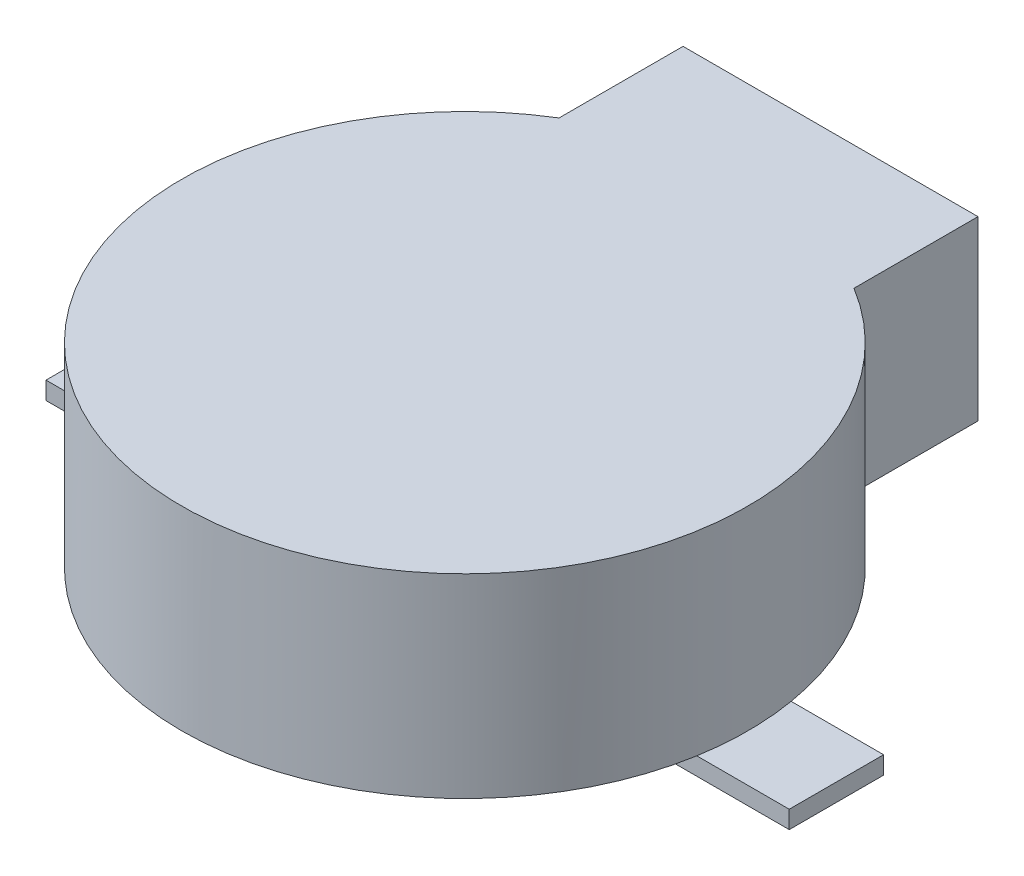
ISO-10303-21;
HEADER;
FILE_DESCRIPTION(('STEP AP214'),'2;1');
FILE_NAME('part.step','',(''),(''),'','','');
FILE_SCHEMA(('AUTOMOTIVE_DESIGN { 1 0 10303 214 1 1 1 1 }'));
ENDSEC;
DATA;
#1=APPLICATION_CONTEXT('core data for automotive mechanical design processes');
#2=APPLICATION_PROTOCOL_DEFINITION('international standard','automotive_design',2000,#1);
#3=PRODUCT_CONTEXT('',#1,'mechanical');
#4=PRODUCT('Part','Part','',(#3));
#5=PRODUCT_RELATED_PRODUCT_CATEGORY('part','',(#4));
#6=PRODUCT_DEFINITION_FORMATION('','',#4);
#7=PRODUCT_DEFINITION_CONTEXT('part definition',#1,'design');
#8=PRODUCT_DEFINITION('design','',#6,#7);
#9=PRODUCT_DEFINITION_SHAPE('','',#8);
#10=(LENGTH_UNIT() NAMED_UNIT(*) SI_UNIT(.MILLI.,.METRE.));
#11=(NAMED_UNIT(*) PLANE_ANGLE_UNIT() SI_UNIT($,.RADIAN.));
#12=(NAMED_UNIT(*) SI_UNIT($,.STERADIAN.) SOLID_ANGLE_UNIT());
#13=UNCERTAINTY_MEASURE_WITH_UNIT(LENGTH_MEASURE(1.E-05),#10,'distance_accuracy_value','');
#14=(GEOMETRIC_REPRESENTATION_CONTEXT(3) GLOBAL_UNCERTAINTY_ASSIGNED_CONTEXT((#13)) GLOBAL_UNIT_ASSIGNED_CONTEXT((#10,
#11,#12)) REPRESENTATION_CONTEXT('',''));
#15=CARTESIAN_POINT('',(0.,0.,0.));
#16=DIRECTION('',(0.,0.,1.));
#17=DIRECTION('',(1.,0.,0.));
#18=AXIS2_PLACEMENT_3D('',#15,#16,#17);
#19=CARTESIAN_POINT('',(2.5,3.3,-4.09756024970958));
#20=DIRECTION('',(-1.,0.,0.));
#21=DIRECTION('',(0.,0.,1.));
#22=AXIS2_PLACEMENT_3D('',#19,#20,#21);
#23=PLANE('',#22);
#24=DIRECTION('',(0.,0.,1.));
#25=VECTOR('',#24,1.);
#26=CARTESIAN_POINT('',(2.5,0.3,-4.09756024970958));
#27=LINE('',#26,#25);
#28=CARTESIAN_POINT('',(2.5,0.3,-6.2));
#29=VERTEX_POINT('',#28);
#30=CARTESIAN_POINT('',(2.5,0.3,-4.09756024970958));
#31=VERTEX_POINT('',#30);
#32=EDGE_CURVE('E206',#29,#31,#27,.T.);
#33=ORIENTED_EDGE('',*,*,#32,.F.);
#34=DIRECTION('',(0.,-1.,0.));
#35=VECTOR('',#34,1.);
#36=CARTESIAN_POINT('',(2.5,3.3,-6.2));
#37=LINE('',#36,#35);
#38=CARTESIAN_POINT('',(2.5,3.3,-6.2));
#39=VERTEX_POINT('',#38);
#40=EDGE_CURVE('E292',#39,#29,#37,.T.);
#41=ORIENTED_EDGE('',*,*,#40,.F.);
#42=DIRECTION('',(0.,0.,-1.));
#43=VECTOR('',#42,1.);
#44=CARTESIAN_POINT('',(2.5,3.3,-4.09756024970958));
#45=LINE('',#44,#43);
#46=CARTESIAN_POINT('',(2.5,3.3,-4.09756024970958));
#47=VERTEX_POINT('',#46);
#48=EDGE_CURVE('E277',#47,#39,#45,.T.);
#49=ORIENTED_EDGE('',*,*,#48,.F.);
#50=DIRECTION('',(0.,-1.,0.));
#51=VECTOR('',#50,1.);
#52=CARTESIAN_POINT('',(2.5,3.3,-4.09756024970958));
#53=LINE('',#52,#51);
#54=EDGE_CURVE('E40',#47,#31,#53,.T.);
#55=ORIENTED_EDGE('',*,*,#54,.T.);
#56=EDGE_LOOP('',(#33,#41,#49,#55));
#57=FACE_BOUND('',#56,.T.);
#58=ADVANCED_FACE('F36',(#57),#23,.F.);
#59=CARTESIAN_POINT('',(-2.5,3.3,-6.2));
#60=DIRECTION('',(0.,0.,1.));
#61=DIRECTION('',(1.,0.,0.));
#62=AXIS2_PLACEMENT_3D('',#59,#60,#61);
#63=PLANE('',#62);
#64=DIRECTION('',(-1.,0.,0.));
#65=VECTOR('',#64,1.);
#66=CARTESIAN_POINT('',(2.,0.8,-6.2));
#67=LINE('',#66,#65);
#68=CARTESIAN_POINT('',(2.,0.8,-6.2));
#69=VERTEX_POINT('',#68);
#70=CARTESIAN_POINT('',(-2.,0.8,-6.2));
#71=VERTEX_POINT('',#70);
#72=EDGE_CURVE('E192',#69,#71,#67,.T.);
#73=ORIENTED_EDGE('',*,*,#72,.F.);
#74=DIRECTION('',(0.,-1.,0.));
#75=VECTOR('',#74,1.);
#76=CARTESIAN_POINT('',(2.,2.8,-6.2));
#77=LINE('',#76,#75);
#78=CARTESIAN_POINT('',(2.,2.8,-6.2));
#79=VERTEX_POINT('',#78);
#80=EDGE_CURVE('E53',#79,#69,#77,.T.);
#81=ORIENTED_EDGE('',*,*,#80,.F.);
#82=DIRECTION('',(1.,0.,0.));
#83=VECTOR('',#82,1.);
#84=CARTESIAN_POINT('',(-2.,2.8,-6.2));
#85=LINE('',#84,#83);
#86=CARTESIAN_POINT('',(-2.,2.8,-6.2));
#87=VERTEX_POINT('',#86);
#88=EDGE_CURVE('E183',#87,#79,#85,.T.);
#89=ORIENTED_EDGE('',*,*,#88,.F.);
#90=DIRECTION('',(0.,1.,0.));
#91=VECTOR('',#90,1.);
#92=CARTESIAN_POINT('',(-2.,0.8,-6.2));
#93=LINE('',#92,#91);
#94=EDGE_CURVE('E186',#71,#87,#93,.T.);
#95=ORIENTED_EDGE('',*,*,#94,.F.);
#96=EDGE_LOOP('',(#73,#81,#89,#95));
#97=FACE_BOUND('',#96,.T.);
#98=DIRECTION('',(1.,0.,0.));
#99=VECTOR('',#98,1.);
#100=CARTESIAN_POINT('',(2.5,0.3,-6.2));
#101=LINE('',#100,#99);
#102=CARTESIAN_POINT('',(-2.5,0.3,-6.2));
#103=VERTEX_POINT('',#102);
#104=EDGE_CURVE('E204',#103,#29,#101,.T.);
#105=ORIENTED_EDGE('',*,*,#104,.F.);
#106=DIRECTION('',(0.,-1.,0.));
#107=VECTOR('',#106,1.);
#108=CARTESIAN_POINT('',(-2.5,3.3,-6.2));
#109=LINE('',#108,#107);
#110=CARTESIAN_POINT('',(-2.5,3.3,-6.2));
#111=VERTEX_POINT('',#110);
#112=EDGE_CURVE('E290',#111,#103,#109,.T.);
#113=ORIENTED_EDGE('',*,*,#112,.F.);
#114=DIRECTION('',(-1.,0.,0.));
#115=VECTOR('',#114,1.);
#116=CARTESIAN_POINT('',(-2.5,3.3,-6.2));
#117=LINE('',#116,#115);
#118=EDGE_CURVE('E280',#39,#111,#117,.T.);
#119=ORIENTED_EDGE('',*,*,#118,.F.);
#120=ORIENTED_EDGE('',*,*,#40,.T.);
#121=EDGE_LOOP('',(#105,#113,#119,#120));
#122=FACE_BOUND('',#121,.T.);
#123=ADVANCED_FACE('F307',(#97,#122),#63,.F.);
#124=CARTESIAN_POINT('',(-2.5,3.3,-4.09756024970958));
#125=DIRECTION('',(1.,0.,0.));
#126=DIRECTION('',(0.,0.,-1.));
#127=AXIS2_PLACEMENT_3D('',#124,#125,#126);
#128=PLANE('',#127);
#129=DIRECTION('',(0.,0.,-1.));
#130=VECTOR('',#129,1.);
#131=CARTESIAN_POINT('',(-2.5,0.3,-6.2));
#132=LINE('',#131,#130);
#133=CARTESIAN_POINT('',(-2.5,0.3,-4.09756024970958));
#134=VERTEX_POINT('',#133);
#135=EDGE_CURVE('E202',#134,#103,#132,.T.);
#136=ORIENTED_EDGE('',*,*,#135,.F.);
#137=DIRECTION('',(0.,-1.,0.));
#138=VECTOR('',#137,1.);
#139=CARTESIAN_POINT('',(-2.5,3.3,-4.09756024970958));
#140=LINE('',#139,#138);
#141=CARTESIAN_POINT('',(-2.5,3.3,-4.09756024970958));
#142=VERTEX_POINT('',#141);
#143=EDGE_CURVE('E284',#142,#134,#140,.T.);
#144=ORIENTED_EDGE('',*,*,#143,.F.);
#145=DIRECTION('',(0.,0.,1.));
#146=VECTOR('',#145,1.);
#147=CARTESIAN_POINT('',(-2.5,3.3,-4.09756024970958));
#148=LINE('',#147,#146);
#149=EDGE_CURVE('E282',#111,#142,#148,.T.);
#150=ORIENTED_EDGE('',*,*,#149,.F.);
#151=ORIENTED_EDGE('',*,*,#112,.T.);
#152=EDGE_LOOP('',(#136,#144,#150,#151));
#153=FACE_BOUND('',#152,.T.);
#154=ADVANCED_FACE('F310',(#153),#128,.F.);
#155=CARTESIAN_POINT('',(0.,0.,0.));
#156=DIRECTION('',(0.,1.,0.));
#157=DIRECTION('',(0.,0.,1.));
#158=AXIS2_PLACEMENT_3D('',#155,#156,#157);
#159=PLANE('',#158);
#160=CARTESIAN_POINT('',(0.,0.,0.));
#161=DIRECTION('',(0.,1.,0.));
#162=DIRECTION('',(0.,0.,1.));
#163=AXIS2_PLACEMENT_3D('',#160,#161,#162);
#164=CIRCLE('',#163,4.8);
#165=CARTESIAN_POINT('',(4.73286382647969,0.,-0.8));
#166=VERTEX_POINT('',#165);
#167=CARTESIAN_POINT('',(-4.73286382647969,0.,-0.8));
#168=VERTEX_POINT('',#167);
#169=EDGE_CURVE('E278',#166,#168,#164,.T.);
#170=ORIENTED_EDGE('',*,*,#169,.F.);
#171=DIRECTION('',(1.,0.,0.));
#172=VECTOR('',#171,1.);
#173=CARTESIAN_POINT('',(2.8,0.,-0.8));
#174=LINE('',#173,#172);
#175=CARTESIAN_POINT('',(2.8,0.,-0.8));
#176=VERTEX_POINT('',#175);
#177=EDGE_CURVE('E223',#176,#166,#174,.T.);
#178=ORIENTED_EDGE('',*,*,#177,.F.);
#179=DIRECTION('',(0.,0.,-1.));
#180=VECTOR('',#179,1.);
#181=CARTESIAN_POINT('',(2.8,0.,0.8));
#182=LINE('',#181,#180);
#183=CARTESIAN_POINT('',(2.8,0.,0.8));
#184=VERTEX_POINT('',#183);
#185=EDGE_CURVE('E208',#184,#176,#182,.T.);
#186=ORIENTED_EDGE('',*,*,#185,.F.);
#187=DIRECTION('',(-1.,0.,0.));
#188=VECTOR('',#187,1.);
#189=CARTESIAN_POINT('',(2.8,0.,0.8));
#190=LINE('',#189,#188);
#191=CARTESIAN_POINT('',(4.73286382647969,0.,0.8));
#192=VERTEX_POINT('',#191);
#193=EDGE_CURVE('E228',#192,#184,#190,.T.);
#194=ORIENTED_EDGE('',*,*,#193,.F.);
#195=CARTESIAN_POINT('',(-4.73286382647969,0.,0.8));
#196=VERTEX_POINT('',#195);
#197=EDGE_CURVE('E353',#196,#192,#164,.T.);
#198=ORIENTED_EDGE('',*,*,#197,.F.);
#199=DIRECTION('',(-1.,0.,0.));
#200=VECTOR('',#199,1.);
#201=CARTESIAN_POINT('',(-6.3,0.,0.8));
#202=LINE('',#201,#200);
#203=CARTESIAN_POINT('',(-2.8,0.,0.8));
#204=VERTEX_POINT('',#203);
#205=EDGE_CURVE('E246',#204,#196,#202,.T.);
#206=ORIENTED_EDGE('',*,*,#205,.F.);
#207=DIRECTION('',(0.,0.,1.));
#208=VECTOR('',#207,1.);
#209=CARTESIAN_POINT('',(-2.8,0.,0.8));
#210=LINE('',#209,#208);
#211=CARTESIAN_POINT('',(-2.8,0.,-0.8));
#212=VERTEX_POINT('',#211);
#213=EDGE_CURVE('E256',#212,#204,#210,.T.);
#214=ORIENTED_EDGE('',*,*,#213,.F.);
#215=DIRECTION('',(1.,0.,0.));
#216=VECTOR('',#215,1.);
#217=CARTESIAN_POINT('',(-6.3,0.,-0.8));
#218=LINE('',#217,#216);
#219=EDGE_CURVE('E11',#168,#212,#218,.T.);
#220=ORIENTED_EDGE('',*,*,#219,.F.);
#221=EDGE_LOOP('',(#170,#178,#186,#194,#198,#206,#214,#220));
#222=FACE_BOUND('',#221,.T.);
#223=ADVANCED_FACE('F323',(#222),#159,.F.);
#224=CARTESIAN_POINT('',(0.,3.3,0.));
#225=DIRECTION('',(0.,-1.,0.));
#226=DIRECTION('',(0.,0.,-1.));
#227=AXIS2_PLACEMENT_3D('',#224,#225,#226);
#228=CYLINDRICAL_SURFACE('',#227,4.8);
#229=EDGE_CURVE('E273',#192,#166,#164,.T.);
#230=ORIENTED_EDGE('',*,*,#229,.T.);
#231=ORIENTED_EDGE('',*,*,#169,.T.);
#232=EDGE_CURVE('E287',#168,#196,#164,.T.);
#233=ORIENTED_EDGE('',*,*,#232,.T.);
#234=ORIENTED_EDGE('',*,*,#197,.T.);
#235=EDGE_LOOP('',(#230,#231,#233,#234));
#236=FACE_BOUND('',#235,.T.);
#237=CARTESIAN_POINT('',(0.,0.3,0.));
#238=DIRECTION('',(0.,1.,0.));
#239=DIRECTION('',(0.,0.,-1.));
#240=AXIS2_PLACEMENT_3D('',#237,#238,#239);
#241=CIRCLE('',#240,4.8);
#242=EDGE_CURVE('E61',#31,#134,#241,.T.);
#243=ORIENTED_EDGE('',*,*,#242,.F.);
#244=ORIENTED_EDGE('',*,*,#54,.F.);
#245=CARTESIAN_POINT('',(0.,3.3,0.));
#246=DIRECTION('',(0.,1.,0.));
#247=DIRECTION('',(0.,0.,1.));
#248=AXIS2_PLACEMENT_3D('',#245,#246,#247);
#249=CIRCLE('',#248,4.8);
#250=EDGE_CURVE('E274',#142,#47,#249,.T.);
#251=ORIENTED_EDGE('',*,*,#250,.F.);
#252=ORIENTED_EDGE('',*,*,#143,.T.);
#253=EDGE_LOOP('',(#243,#244,#251,#252));
#254=FACE_BOUND('',#253,.T.);
#255=ADVANCED_FACE('F38',(#236,#254),#228,.T.);
#256=CARTESIAN_POINT('',(0.,3.3,0.));
#257=DIRECTION('',(0.,1.,0.));
#258=DIRECTION('',(0.,0.,1.));
#259=AXIS2_PLACEMENT_3D('',#256,#257,#258);
#260=PLANE('',#259);
#261=ORIENTED_EDGE('',*,*,#250,.T.);
#262=ORIENTED_EDGE('',*,*,#48,.T.);
#263=ORIENTED_EDGE('',*,*,#118,.T.);
#264=ORIENTED_EDGE('',*,*,#149,.T.);
#265=EDGE_LOOP('',(#261,#262,#263,#264));
#266=FACE_BOUND('',#265,.T.);
#267=ADVANCED_FACE('F312',(#266),#260,.T.);
#268=CARTESIAN_POINT('',(-6.3,-0.3,0.8));
#269=DIRECTION('',(1.,0.,0.));
#270=DIRECTION('',(0.,0.,-1.));
#271=AXIS2_PLACEMENT_3D('',#268,#269,#270);
#272=PLANE('',#271);
#273=DIRECTION('',(0.,0.,-1.));
#274=VECTOR('',#273,1.);
#275=CARTESIAN_POINT('',(-6.3,0.,0.8));
#276=LINE('',#275,#274);
#277=CARTESIAN_POINT('',(-6.3,0.,0.8));
#278=VERTEX_POINT('',#277);
#279=CARTESIAN_POINT('',(-6.3,0.,-0.8));
#280=VERTEX_POINT('',#279);
#281=EDGE_CURVE('E241',#278,#280,#276,.T.);
#282=ORIENTED_EDGE('',*,*,#281,.T.);
#283=DIRECTION('',(0.,1.,0.));
#284=VECTOR('',#283,1.);
#285=CARTESIAN_POINT('',(-6.3,-0.3,-0.8));
#286=LINE('',#285,#284);
#287=CARTESIAN_POINT('',(-6.3,-0.3,-0.8));
#288=VERTEX_POINT('',#287);
#289=EDGE_CURVE('E270',#288,#280,#286,.T.);
#290=ORIENTED_EDGE('',*,*,#289,.F.);
#291=DIRECTION('',(0.,0.,-1.));
#292=VECTOR('',#291,1.);
#293=CARTESIAN_POINT('',(-6.3,-0.3,0.8));
#294=LINE('',#293,#292);
#295=CARTESIAN_POINT('',(-6.3,-0.3,0.8));
#296=VERTEX_POINT('',#295);
#297=EDGE_CURVE('E242',#296,#288,#294,.T.);
#298=ORIENTED_EDGE('',*,*,#297,.F.);
#299=DIRECTION('',(0.,1.,0.));
#300=VECTOR('',#299,1.);
#301=CARTESIAN_POINT('',(-6.3,-0.3,0.8));
#302=LINE('',#301,#300);
#303=EDGE_CURVE('E252',#296,#278,#302,.T.);
#304=ORIENTED_EDGE('',*,*,#303,.T.);
#305=EDGE_LOOP('',(#282,#290,#298,#304));
#306=FACE_BOUND('',#305,.T.);
#307=ADVANCED_FACE('F314',(#306),#272,.F.);
#308=CARTESIAN_POINT('',(-6.3,-0.3,-0.8));
#309=DIRECTION('',(0.,0.,1.));
#310=DIRECTION('',(1.,0.,0.));
#311=AXIS2_PLACEMENT_3D('',#308,#309,#310);
#312=PLANE('',#311);
#313=EDGE_CURVE('E46',#280,#168,#218,.T.);
#314=ORIENTED_EDGE('',*,*,#313,.T.);
#315=ORIENTED_EDGE('',*,*,#219,.T.);
#316=DIRECTION('',(0.,1.,0.));
#317=VECTOR('',#316,1.);
#318=CARTESIAN_POINT('',(-2.8,-0.3,-0.8));
#319=LINE('',#318,#317);
#320=CARTESIAN_POINT('',(-2.8,-0.3,-0.8));
#321=VERTEX_POINT('',#320);
#322=EDGE_CURVE('E267',#321,#212,#319,.T.);
#323=ORIENTED_EDGE('',*,*,#322,.F.);
#324=DIRECTION('',(1.,0.,0.));
#325=VECTOR('',#324,1.);
#326=CARTESIAN_POINT('',(-6.3,-0.3,-0.8));
#327=LINE('',#326,#325);
#328=EDGE_CURVE('E245',#288,#321,#327,.T.);
#329=ORIENTED_EDGE('',*,*,#328,.F.);
#330=ORIENTED_EDGE('',*,*,#289,.T.);
#331=EDGE_LOOP('',(#314,#315,#323,#329,#330));
#332=FACE_BOUND('',#331,.T.);
#333=ADVANCED_FACE('F320',(#332),#312,.F.);
#334=CARTESIAN_POINT('',(-2.8,-0.3,0.8));
#335=DIRECTION('',(-1.,0.,0.));
#336=DIRECTION('',(0.,0.,1.));
#337=AXIS2_PLACEMENT_3D('',#334,#335,#336);
#338=PLANE('',#337);
#339=ORIENTED_EDGE('',*,*,#213,.T.);
#340=DIRECTION('',(0.,1.,0.));
#341=VECTOR('',#340,1.);
#342=CARTESIAN_POINT('',(-2.8,-0.3,0.8));
#343=LINE('',#342,#341);
#344=CARTESIAN_POINT('',(-2.8,-0.3,0.8));
#345=VERTEX_POINT('',#344);
#346=EDGE_CURVE('E264',#345,#204,#343,.T.);
#347=ORIENTED_EDGE('',*,*,#346,.F.);
#348=DIRECTION('',(0.,0.,1.));
#349=VECTOR('',#348,1.);
#350=CARTESIAN_POINT('',(-2.8,-0.3,0.8));
#351=LINE('',#350,#349);
#352=EDGE_CURVE('E248',#321,#345,#351,.T.);
#353=ORIENTED_EDGE('',*,*,#352,.F.);
#354=ORIENTED_EDGE('',*,*,#322,.T.);
#355=EDGE_LOOP('',(#339,#347,#353,#354));
#356=FACE_BOUND('',#355,.T.);
#357=ADVANCED_FACE('F365',(#356),#338,.F.);
#358=CARTESIAN_POINT('',(-6.3,-0.3,0.8));
#359=DIRECTION('',(0.,0.,-1.));
#360=DIRECTION('',(-1.,0.,0.));
#361=AXIS2_PLACEMENT_3D('',#358,#359,#360);
#362=PLANE('',#361);
#363=ORIENTED_EDGE('',*,*,#205,.T.);
#364=EDGE_CURVE('E259',#196,#278,#202,.T.);
#365=ORIENTED_EDGE('',*,*,#364,.T.);
#366=ORIENTED_EDGE('',*,*,#303,.F.);
#367=DIRECTION('',(-1.,0.,0.));
#368=VECTOR('',#367,1.);
#369=CARTESIAN_POINT('',(-6.3,-0.3,0.8));
#370=LINE('',#369,#368);
#371=EDGE_CURVE('E250',#345,#296,#370,.T.);
#372=ORIENTED_EDGE('',*,*,#371,.F.);
#373=ORIENTED_EDGE('',*,*,#346,.T.);
#374=EDGE_LOOP('',(#363,#365,#366,#372,#373));
#375=FACE_BOUND('',#374,.T.);
#376=ADVANCED_FACE('F360',(#375),#362,.F.);
#377=CARTESIAN_POINT('',(0.,-0.3,0.));
#378=DIRECTION('',(0.,-1.,0.));
#379=DIRECTION('',(0.,0.,-1.));
#380=AXIS2_PLACEMENT_3D('',#377,#378,#379);
#381=PLANE('',#380);
#382=ORIENTED_EDGE('',*,*,#297,.T.);
#383=ORIENTED_EDGE('',*,*,#328,.T.);
#384=ORIENTED_EDGE('',*,*,#352,.T.);
#385=ORIENTED_EDGE('',*,*,#371,.T.);
#386=EDGE_LOOP('',(#382,#383,#384,#385));
#387=FACE_BOUND('',#386,.T.);
#388=ADVANCED_FACE('F372',(#387),#381,.T.);
#389=CARTESIAN_POINT('',(0.,0.,0.));
#390=DIRECTION('',(0.,-1.,0.));
#391=DIRECTION('',(0.,0.,-1.));
#392=AXIS2_PLACEMENT_3D('',#389,#390,#391);
#393=PLANE('',#392);
#394=ORIENTED_EDGE('',*,*,#232,.F.);
#395=ORIENTED_EDGE('',*,*,#313,.F.);
#396=ORIENTED_EDGE('',*,*,#281,.F.);
#397=ORIENTED_EDGE('',*,*,#364,.F.);
#398=EDGE_LOOP('',(#394,#395,#396,#397));
#399=FACE_BOUND('',#398,.T.);
#400=ADVANCED_FACE('F357',(#399),#393,.F.);
#401=CARTESIAN_POINT('',(2.8,-0.3,0.8));
#402=DIRECTION('',(1.,0.,0.));
#403=DIRECTION('',(0.,0.,-1.));
#404=AXIS2_PLACEMENT_3D('',#401,#402,#403);
#405=PLANE('',#404);
#406=ORIENTED_EDGE('',*,*,#185,.T.);
#407=DIRECTION('',(0.,1.,0.));
#408=VECTOR('',#407,1.);
#409=CARTESIAN_POINT('',(2.8,-0.3,-0.8));
#410=LINE('',#409,#408);
#411=CARTESIAN_POINT('',(2.8,-0.3,-0.8));
#412=VERTEX_POINT('',#411);
#413=EDGE_CURVE('E239',#412,#176,#410,.T.);
#414=ORIENTED_EDGE('',*,*,#413,.F.);
#415=DIRECTION('',(0.,0.,-1.));
#416=VECTOR('',#415,1.);
#417=CARTESIAN_POINT('',(2.8,-0.3,0.8));
#418=LINE('',#417,#416);
#419=CARTESIAN_POINT('',(2.8,-0.3,0.8));
#420=VERTEX_POINT('',#419);
#421=EDGE_CURVE('E209',#420,#412,#418,.T.);
#422=ORIENTED_EDGE('',*,*,#421,.F.);
#423=DIRECTION('',(0.,1.,0.));
#424=VECTOR('',#423,1.);
#425=CARTESIAN_POINT('',(2.8,-0.3,0.8));
#426=LINE('',#425,#424);
#427=EDGE_CURVE('E219',#420,#184,#426,.T.);
#428=ORIENTED_EDGE('',*,*,#427,.T.);
#429=EDGE_LOOP('',(#406,#414,#422,#428));
#430=FACE_BOUND('',#429,.T.);
#431=ADVANCED_FACE('F379',(#430),#405,.F.);
#432=CARTESIAN_POINT('',(2.8,-0.3,-0.8));
#433=DIRECTION('',(0.,0.,1.));
#434=DIRECTION('',(1.,0.,0.));
#435=AXIS2_PLACEMENT_3D('',#432,#433,#434);
#436=PLANE('',#435);
#437=ORIENTED_EDGE('',*,*,#177,.T.);
#438=CARTESIAN_POINT('',(6.3,0.,-0.8));
#439=VERTEX_POINT('',#438);
#440=EDGE_CURVE('E222',#166,#439,#174,.T.);
#441=ORIENTED_EDGE('',*,*,#440,.T.);
#442=DIRECTION('',(0.,1.,0.));
#443=VECTOR('',#442,1.);
#444=CARTESIAN_POINT('',(6.3,-0.3,-0.8));
#445=LINE('',#444,#443);
#446=CARTESIAN_POINT('',(6.3,-0.3,-0.8));
#447=VERTEX_POINT('',#446);
#448=EDGE_CURVE('E236',#447,#439,#445,.T.);
#449=ORIENTED_EDGE('',*,*,#448,.F.);
#450=DIRECTION('',(1.,0.,0.));
#451=VECTOR('',#450,1.);
#452=CARTESIAN_POINT('',(2.8,-0.3,-0.8));
#453=LINE('',#452,#451);
#454=EDGE_CURVE('E212',#412,#447,#453,.T.);
#455=ORIENTED_EDGE('',*,*,#454,.F.);
#456=ORIENTED_EDGE('',*,*,#413,.T.);
#457=EDGE_LOOP('',(#437,#441,#449,#455,#456));
#458=FACE_BOUND('',#457,.T.);
#459=ADVANCED_FACE('F345',(#458),#436,.F.);
#460=CARTESIAN_POINT('',(6.3,-0.3,0.8));
#461=DIRECTION('',(-1.,0.,0.));
#462=DIRECTION('',(0.,0.,1.));
#463=AXIS2_PLACEMENT_3D('',#460,#461,#462);
#464=PLANE('',#463);
#465=DIRECTION('',(0.,0.,1.));
#466=VECTOR('',#465,1.);
#467=CARTESIAN_POINT('',(6.3,0.,0.8));
#468=LINE('',#467,#466);
#469=CARTESIAN_POINT('',(6.3,0.,0.8));
#470=VERTEX_POINT('',#469);
#471=EDGE_CURVE('E226',#439,#470,#468,.T.);
#472=ORIENTED_EDGE('',*,*,#471,.T.);
#473=DIRECTION('',(0.,1.,0.));
#474=VECTOR('',#473,1.);
#475=CARTESIAN_POINT('',(6.3,-0.3,0.8));
#476=LINE('',#475,#474);
#477=CARTESIAN_POINT('',(6.3,-0.3,0.8));
#478=VERTEX_POINT('',#477);
#479=EDGE_CURVE('E233',#478,#470,#476,.T.);
#480=ORIENTED_EDGE('',*,*,#479,.F.);
#481=DIRECTION('',(0.,0.,1.));
#482=VECTOR('',#481,1.);
#483=CARTESIAN_POINT('',(6.3,-0.3,0.8));
#484=LINE('',#483,#482);
#485=EDGE_CURVE('E215',#447,#478,#484,.T.);
#486=ORIENTED_EDGE('',*,*,#485,.F.);
#487=ORIENTED_EDGE('',*,*,#448,.T.);
#488=EDGE_LOOP('',(#472,#480,#486,#487));
#489=FACE_BOUND('',#488,.T.);
#490=ADVANCED_FACE('F427',(#489),#464,.F.);
#491=CARTESIAN_POINT('',(2.8,-0.3,0.8));
#492=DIRECTION('',(0.,0.,-1.));
#493=DIRECTION('',(-1.,0.,0.));
#494=AXIS2_PLACEMENT_3D('',#491,#492,#493);
#495=PLANE('',#494);
#496=EDGE_CURVE('E213',#470,#192,#190,.T.);
#497=ORIENTED_EDGE('',*,*,#496,.T.);
#498=ORIENTED_EDGE('',*,*,#193,.T.);
#499=ORIENTED_EDGE('',*,*,#427,.F.);
#500=DIRECTION('',(-1.,0.,0.));
#501=VECTOR('',#500,1.);
#502=CARTESIAN_POINT('',(2.8,-0.3,0.8));
#503=LINE('',#502,#501);
#504=EDGE_CURVE('E217',#478,#420,#503,.T.);
#505=ORIENTED_EDGE('',*,*,#504,.F.);
#506=ORIENTED_EDGE('',*,*,#479,.T.);
#507=EDGE_LOOP('',(#497,#498,#499,#505,#506));
#508=FACE_BOUND('',#507,.T.);
#509=ADVANCED_FACE('F435',(#508),#495,.F.);
#510=CARTESIAN_POINT('',(0.,-0.3,0.));
#511=DIRECTION('',(0.,-1.,0.));
#512=DIRECTION('',(0.,0.,-1.));
#513=AXIS2_PLACEMENT_3D('',#510,#511,#512);
#514=PLANE('',#513);
#515=ORIENTED_EDGE('',*,*,#421,.T.);
#516=ORIENTED_EDGE('',*,*,#454,.T.);
#517=ORIENTED_EDGE('',*,*,#485,.T.);
#518=ORIENTED_EDGE('',*,*,#504,.T.);
#519=EDGE_LOOP('',(#515,#516,#517,#518));
#520=FACE_BOUND('',#519,.T.);
#521=ADVANCED_FACE('F445',(#520),#514,.T.);
#522=CARTESIAN_POINT('',(0.,0.,0.));
#523=DIRECTION('',(0.,-1.,0.));
#524=DIRECTION('',(0.,0.,-1.));
#525=AXIS2_PLACEMENT_3D('',#522,#523,#524);
#526=PLANE('',#525);
#527=ORIENTED_EDGE('',*,*,#440,.F.);
#528=ORIENTED_EDGE('',*,*,#229,.F.);
#529=ORIENTED_EDGE('',*,*,#496,.F.);
#530=ORIENTED_EDGE('',*,*,#471,.F.);
#531=EDGE_LOOP('',(#527,#528,#529,#530));
#532=FACE_BOUND('',#531,.T.);
#533=ADVANCED_FACE('F350',(#532),#526,.F.);
#534=CARTESIAN_POINT('',(0.,0.3,0.));
#535=DIRECTION('',(0.,-1.,0.));
#536=DIRECTION('',(0.,0.,-1.));
#537=AXIS2_PLACEMENT_3D('',#534,#535,#536);
#538=PLANE('',#537);
#539=ORIENTED_EDGE('',*,*,#242,.T.);
#540=ORIENTED_EDGE('',*,*,#135,.T.);
#541=ORIENTED_EDGE('',*,*,#104,.T.);
#542=ORIENTED_EDGE('',*,*,#32,.T.);
#543=EDGE_LOOP('',(#539,#540,#541,#542));
#544=FACE_BOUND('',#543,.T.);
#545=ADVANCED_FACE('F305',(#544),#538,.T.);
#546=CARTESIAN_POINT('',(2.,2.8,-3.2));
#547=DIRECTION('',(1.,0.,0.));
#548=DIRECTION('',(0.,0.,-1.));
#549=AXIS2_PLACEMENT_3D('',#546,#547,#548);
#550=PLANE('',#549);
#551=ORIENTED_EDGE('',*,*,#80,.T.);
#552=DIRECTION('',(0.,0.,-1.));
#553=VECTOR('',#552,1.);
#554=CARTESIAN_POINT('',(2.,0.8,-3.2));
#555=LINE('',#554,#553);
#556=CARTESIAN_POINT('',(2.,0.8,-3.2));
#557=VERTEX_POINT('',#556);
#558=EDGE_CURVE('E161',#557,#69,#555,.T.);
#559=ORIENTED_EDGE('',*,*,#558,.F.);
#560=DIRECTION('',(0.,-1.,0.));
#561=VECTOR('',#560,1.);
#562=CARTESIAN_POINT('',(2.,2.8,-3.2));
#563=LINE('',#562,#561);
#564=CARTESIAN_POINT('',(2.,2.8,-3.2));
#565=VERTEX_POINT('',#564);
#566=EDGE_CURVE('E165',#565,#557,#563,.T.);
#567=ORIENTED_EDGE('',*,*,#566,.F.);
#568=DIRECTION('',(0.,0.,-1.));
#569=VECTOR('',#568,1.);
#570=CARTESIAN_POINT('',(2.,2.8,-3.2));
#571=LINE('',#570,#569);
#572=EDGE_CURVE('E196',#565,#79,#571,.T.);
#573=ORIENTED_EDGE('',*,*,#572,.T.);
#574=EDGE_LOOP('',(#551,#559,#567,#573));
#575=FACE_BOUND('',#574,.T.);
#576=ADVANCED_FACE('F163',(#575),#550,.F.);
#577=CARTESIAN_POINT('',(-2.,2.8,-3.2));
#578=DIRECTION('',(0.,1.,0.));
#579=DIRECTION('',(0.,0.,1.));
#580=AXIS2_PLACEMENT_3D('',#577,#578,#579);
#581=PLANE('',#580);
#582=ORIENTED_EDGE('',*,*,#88,.T.);
#583=ORIENTED_EDGE('',*,*,#572,.F.);
#584=DIRECTION('',(1.,0.,0.));
#585=VECTOR('',#584,1.);
#586=CARTESIAN_POINT('',(-2.,2.8,-3.2));
#587=LINE('',#586,#585);
#588=CARTESIAN_POINT('',(-2.,2.8,-3.2));
#589=VERTEX_POINT('',#588);
#590=EDGE_CURVE('E171',#589,#565,#587,.T.);
#591=ORIENTED_EDGE('',*,*,#590,.F.);
#592=DIRECTION('',(0.,0.,-1.));
#593=VECTOR('',#592,1.);
#594=CARTESIAN_POINT('',(-2.,2.8,-3.2));
#595=LINE('',#594,#593);
#596=EDGE_CURVE('E198',#589,#87,#595,.T.);
#597=ORIENTED_EDGE('',*,*,#596,.T.);
#598=EDGE_LOOP('',(#582,#583,#591,#597));
#599=FACE_BOUND('',#598,.T.);
#600=ADVANCED_FACE('F521',(#599),#581,.F.);
#601=CARTESIAN_POINT('',(-2.,0.8,-3.2));
#602=DIRECTION('',(-1.,0.,0.));
#603=DIRECTION('',(0.,0.,1.));
#604=AXIS2_PLACEMENT_3D('',#601,#602,#603);
#605=PLANE('',#604);
#606=ORIENTED_EDGE('',*,*,#94,.T.);
#607=ORIENTED_EDGE('',*,*,#596,.F.);
#608=DIRECTION('',(0.,1.,0.));
#609=VECTOR('',#608,1.);
#610=CARTESIAN_POINT('',(-2.,0.8,-3.2));
#611=LINE('',#610,#609);
#612=CARTESIAN_POINT('',(-2.,0.8,-3.2));
#613=VERTEX_POINT('',#612);
#614=EDGE_CURVE('E179',#613,#589,#611,.T.);
#615=ORIENTED_EDGE('',*,*,#614,.F.);
#616=DIRECTION('',(0.,0.,-1.));
#617=VECTOR('',#616,1.);
#618=CARTESIAN_POINT('',(-2.,0.8,-3.2));
#619=LINE('',#618,#617);
#620=EDGE_CURVE('E170',#613,#71,#619,.T.);
#621=ORIENTED_EDGE('',*,*,#620,.T.);
#622=EDGE_LOOP('',(#606,#607,#615,#621));
#623=FACE_BOUND('',#622,.T.);
#624=ADVANCED_FACE('F530',(#623),#605,.F.);
#625=CARTESIAN_POINT('',(2.,0.8,-3.2));
#626=DIRECTION('',(0.,-1.,0.));
#627=DIRECTION('',(0.,0.,-1.));
#628=AXIS2_PLACEMENT_3D('',#625,#626,#627);
#629=PLANE('',#628);
#630=ORIENTED_EDGE('',*,*,#72,.T.);
#631=ORIENTED_EDGE('',*,*,#620,.F.);
#632=DIRECTION('',(-1.,0.,0.));
#633=VECTOR('',#632,1.);
#634=CARTESIAN_POINT('',(2.,0.8,-3.2));
#635=LINE('',#634,#633);
#636=EDGE_CURVE('E174',#557,#613,#635,.T.);
#637=ORIENTED_EDGE('',*,*,#636,.F.);
#638=ORIENTED_EDGE('',*,*,#558,.T.);
#639=EDGE_LOOP('',(#630,#631,#637,#638));
#640=FACE_BOUND('',#639,.T.);
#641=ADVANCED_FACE('F175',(#640),#629,.F.);
#642=CARTESIAN_POINT('',(0.,0.,-3.2));
#643=DIRECTION('',(0.,0.,-1.));
#644=DIRECTION('',(-1.,0.,0.));
#645=AXIS2_PLACEMENT_3D('',#642,#643,#644);
#646=PLANE('',#645);
#647=ORIENTED_EDGE('',*,*,#566,.T.);
#648=ORIENTED_EDGE('',*,*,#636,.T.);
#649=ORIENTED_EDGE('',*,*,#614,.T.);
#650=ORIENTED_EDGE('',*,*,#590,.T.);
#651=EDGE_LOOP('',(#647,#648,#649,#650));
#652=FACE_BOUND('',#651,.T.);
#653=ADVANCED_FACE('F181',(#652),#646,.T.);
#654=CLOSED_SHELL('',(#58,#123,#154,#223,#255,#267,#307,#333,#357,#376,#388,#400,#431,#459,#490,
#509,#521,#533,#545,#576,#600,#624,#641,#653));
#655=MANIFOLD_SOLID_BREP('B2',#654);
#656=ADVANCED_BREP_SHAPE_REPRESENTATION('',(#18,#655),#14);
#657=SHAPE_DEFINITION_REPRESENTATION(#9,#656);
ENDSEC;
END-ISO-10303-21;
